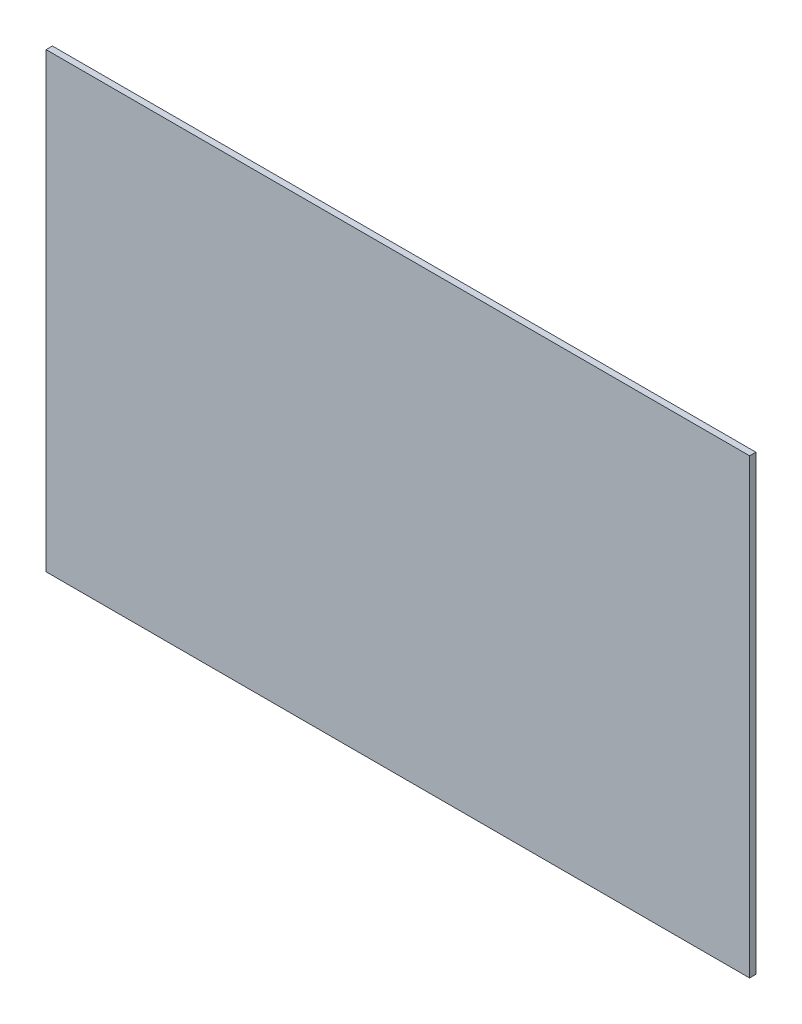
ISO-10303-21;
HEADER;
FILE_DESCRIPTION(('STEP AP214'),'2;1');
FILE_NAME('part.step','',(''),(''),'','','');
FILE_SCHEMA(('AUTOMOTIVE_DESIGN { 1 0 10303 214 1 1 1 1 }'));
ENDSEC;
DATA;
#1=APPLICATION_CONTEXT('core data for automotive mechanical design processes');
#2=APPLICATION_PROTOCOL_DEFINITION('international standard','automotive_design',2000,#1);
#3=PRODUCT_CONTEXT('',#1,'mechanical');
#4=PRODUCT('Part','Part','',(#3));
#5=PRODUCT_RELATED_PRODUCT_CATEGORY('part','',(#4));
#6=PRODUCT_DEFINITION_FORMATION('','',#4);
#7=PRODUCT_DEFINITION_CONTEXT('part definition',#1,'design');
#8=PRODUCT_DEFINITION('design','',#6,#7);
#9=PRODUCT_DEFINITION_SHAPE('','',#8);
#10=(LENGTH_UNIT() NAMED_UNIT(*) SI_UNIT(.MILLI.,.METRE.));
#11=(NAMED_UNIT(*) PLANE_ANGLE_UNIT() SI_UNIT($,.RADIAN.));
#12=(NAMED_UNIT(*) SI_UNIT($,.STERADIAN.) SOLID_ANGLE_UNIT());
#13=UNCERTAINTY_MEASURE_WITH_UNIT(LENGTH_MEASURE(1.E-05),#10,'distance_accuracy_value','');
#14=(GEOMETRIC_REPRESENTATION_CONTEXT(3) GLOBAL_UNCERTAINTY_ASSIGNED_CONTEXT((#13)) GLOBAL_UNIT_ASSIGNED_CONTEXT((#10,
#11,#12)) REPRESENTATION_CONTEXT('',''));
#15=CARTESIAN_POINT('',(0.,0.,0.));
#16=DIRECTION('',(0.,0.,1.));
#17=DIRECTION('',(1.,0.,0.));
#18=AXIS2_PLACEMENT_3D('',#15,#16,#17);
#19=CARTESIAN_POINT('',(0.,0.,3.175));
#20=DIRECTION('',(1.,0.,0.));
#21=DIRECTION('',(0.,0.,-1.));
#22=AXIS2_PLACEMENT_3D('',#19,#20,#21);
#23=PLANE('',#22);
#24=DIRECTION('',(0.,-1.,0.));
#25=VECTOR('',#24,1.);
#26=CARTESIAN_POINT('',(0.,0.,0.));
#27=LINE('',#26,#25);
#28=CARTESIAN_POINT('',(0.,228.6,0.));
#29=VERTEX_POINT('',#28);
#30=CARTESIAN_POINT('',(0.,0.,0.));
#31=VERTEX_POINT('',#30);
#32=EDGE_CURVE('E113',#29,#31,#27,.T.);
#33=ORIENTED_EDGE('',*,*,#32,.T.);
#34=DIRECTION('',(0.,0.,-1.));
#35=VECTOR('',#34,1.);
#36=CARTESIAN_POINT('',(0.,0.,3.175));
#37=LINE('',#36,#35);
#38=CARTESIAN_POINT('',(0.,0.,3.175));
#39=VERTEX_POINT('',#38);
#40=EDGE_CURVE('E11',#39,#31,#37,.T.);
#41=ORIENTED_EDGE('',*,*,#40,.F.);
#42=DIRECTION('',(0.,-1.,0.));
#43=VECTOR('',#42,1.);
#44=CARTESIAN_POINT('',(0.,0.,3.175));
#45=LINE('',#44,#43);
#46=CARTESIAN_POINT('',(0.,228.6,3.175));
#47=VERTEX_POINT('',#46);
#48=EDGE_CURVE('E97',#47,#39,#45,.T.);
#49=ORIENTED_EDGE('',*,*,#48,.F.);
#50=DIRECTION('',(0.,0.,-1.));
#51=VECTOR('',#50,1.);
#52=CARTESIAN_POINT('',(0.,228.6,3.175));
#53=LINE('',#52,#51);
#54=EDGE_CURVE('E109',#47,#29,#53,.T.);
#55=ORIENTED_EDGE('',*,*,#54,.T.);
#56=EDGE_LOOP('',(#33,#41,#49,#55));
#57=FACE_BOUND('',#56,.T.);
#58=ADVANCED_FACE('F45',(#57),#23,.F.);
#59=CARTESIAN_POINT('',(0.,0.,3.175));
#60=DIRECTION('',(0.,1.,0.));
#61=DIRECTION('',(0.,0.,1.));
#62=AXIS2_PLACEMENT_3D('',#59,#60,#61);
#63=PLANE('',#62);
#64=DIRECTION('',(1.,0.,0.));
#65=VECTOR('',#64,1.);
#66=CARTESIAN_POINT('',(0.,0.,0.));
#67=LINE('',#66,#65);
#68=CARTESIAN_POINT('',(355.6,0.,0.));
#69=VERTEX_POINT('',#68);
#70=EDGE_CURVE('E102',#31,#69,#67,.T.);
#71=ORIENTED_EDGE('',*,*,#70,.T.);
#72=DIRECTION('',(0.,0.,-1.));
#73=VECTOR('',#72,1.);
#74=CARTESIAN_POINT('',(355.6,0.,3.175));
#75=LINE('',#74,#73);
#76=CARTESIAN_POINT('',(355.6,0.,3.175));
#77=VERTEX_POINT('',#76);
#78=EDGE_CURVE('E54',#77,#69,#75,.T.);
#79=ORIENTED_EDGE('',*,*,#78,.F.);
#80=DIRECTION('',(1.,0.,0.));
#81=VECTOR('',#80,1.);
#82=CARTESIAN_POINT('',(0.,0.,3.175));
#83=LINE('',#82,#81);
#84=EDGE_CURVE('E92',#39,#77,#83,.T.);
#85=ORIENTED_EDGE('',*,*,#84,.F.);
#86=ORIENTED_EDGE('',*,*,#40,.T.);
#87=EDGE_LOOP('',(#71,#79,#85,#86));
#88=FACE_BOUND('',#87,.T.);
#89=ADVANCED_FACE('F101',(#88),#63,.F.);
#90=CARTESIAN_POINT('',(355.6,0.,3.175));
#91=DIRECTION('',(-1.,0.,0.));
#92=DIRECTION('',(0.,0.,1.));
#93=AXIS2_PLACEMENT_3D('',#90,#91,#92);
#94=PLANE('',#93);
#95=DIRECTION('',(0.,1.,0.));
#96=VECTOR('',#95,1.);
#97=CARTESIAN_POINT('',(355.6,0.,0.));
#98=LINE('',#97,#96);
#99=CARTESIAN_POINT('',(355.6,228.6,0.));
#100=VERTEX_POINT('',#99);
#101=EDGE_CURVE('E79',#69,#100,#98,.T.);
#102=ORIENTED_EDGE('',*,*,#101,.T.);
#103=DIRECTION('',(0.,0.,-1.));
#104=VECTOR('',#103,1.);
#105=CARTESIAN_POINT('',(355.6,228.6,3.175));
#106=LINE('',#105,#104);
#107=CARTESIAN_POINT('',(355.6,228.6,3.175));
#108=VERTEX_POINT('',#107);
#109=EDGE_CURVE('E104',#108,#100,#106,.T.);
#110=ORIENTED_EDGE('',*,*,#109,.F.);
#111=DIRECTION('',(0.,1.,0.));
#112=VECTOR('',#111,1.);
#113=CARTESIAN_POINT('',(355.6,0.,3.175));
#114=LINE('',#113,#112);
#115=EDGE_CURVE('E95',#77,#108,#114,.T.);
#116=ORIENTED_EDGE('',*,*,#115,.F.);
#117=ORIENTED_EDGE('',*,*,#78,.T.);
#118=EDGE_LOOP('',(#102,#110,#116,#117));
#119=FACE_BOUND('',#118,.T.);
#120=ADVANCED_FACE('F105',(#119),#94,.F.);
#121=CARTESIAN_POINT('',(0.,228.6,3.175));
#122=DIRECTION('',(0.,-1.,0.));
#123=DIRECTION('',(0.,0.,-1.));
#124=AXIS2_PLACEMENT_3D('',#121,#122,#123);
#125=PLANE('',#124);
#126=DIRECTION('',(-1.,0.,0.));
#127=VECTOR('',#126,1.);
#128=CARTESIAN_POINT('',(0.,228.6,0.));
#129=LINE('',#128,#127);
#130=EDGE_CURVE('E85',#100,#29,#129,.T.);
#131=ORIENTED_EDGE('',*,*,#130,.T.);
#132=ORIENTED_EDGE('',*,*,#54,.F.);
#133=DIRECTION('',(-1.,0.,0.));
#134=VECTOR('',#133,1.);
#135=CARTESIAN_POINT('',(0.,228.6,3.175));
#136=LINE('',#135,#134);
#137=EDGE_CURVE('E62',#108,#47,#136,.T.);
#138=ORIENTED_EDGE('',*,*,#137,.F.);
#139=ORIENTED_EDGE('',*,*,#109,.T.);
#140=EDGE_LOOP('',(#131,#132,#138,#139));
#141=FACE_BOUND('',#140,.T.);
#142=ADVANCED_FACE('F126',(#141),#125,.F.);
#143=CARTESIAN_POINT('',(0.,0.,3.175));
#144=DIRECTION('',(0.,0.,-1.));
#145=DIRECTION('',(-1.,0.,0.));
#146=AXIS2_PLACEMENT_3D('',#143,#144,#145);
#147=PLANE('',#146);
#148=ORIENTED_EDGE('',*,*,#48,.T.);
#149=ORIENTED_EDGE('',*,*,#84,.T.);
#150=ORIENTED_EDGE('',*,*,#115,.T.);
#151=ORIENTED_EDGE('',*,*,#137,.T.);
#152=EDGE_LOOP('',(#148,#149,#150,#151));
#153=FACE_BOUND('',#152,.T.);
#154=ADVANCED_FACE('F93',(#153),#147,.F.);
#155=CARTESIAN_POINT('',(0.,0.,0.));
#156=DIRECTION('',(0.,0.,-1.));
#157=DIRECTION('',(-1.,0.,0.));
#158=AXIS2_PLACEMENT_3D('',#155,#156,#157);
#159=PLANE('',#158);
#160=ORIENTED_EDGE('',*,*,#32,.F.);
#161=ORIENTED_EDGE('',*,*,#130,.F.);
#162=ORIENTED_EDGE('',*,*,#101,.F.);
#163=ORIENTED_EDGE('',*,*,#70,.F.);
#164=EDGE_LOOP('',(#160,#161,#162,#163));
#165=FACE_BOUND('',#164,.T.);
#166=ADVANCED_FACE('F129',(#165),#159,.T.);
#167=CLOSED_SHELL('',(#58,#89,#120,#142,#154,#166));
#168=MANIFOLD_SOLID_BREP('B2',#167);
#169=ADVANCED_BREP_SHAPE_REPRESENTATION('',(#18,#168),#14);
#170=SHAPE_DEFINITION_REPRESENTATION(#9,#169);
ENDSEC;
END-ISO-10303-21;
